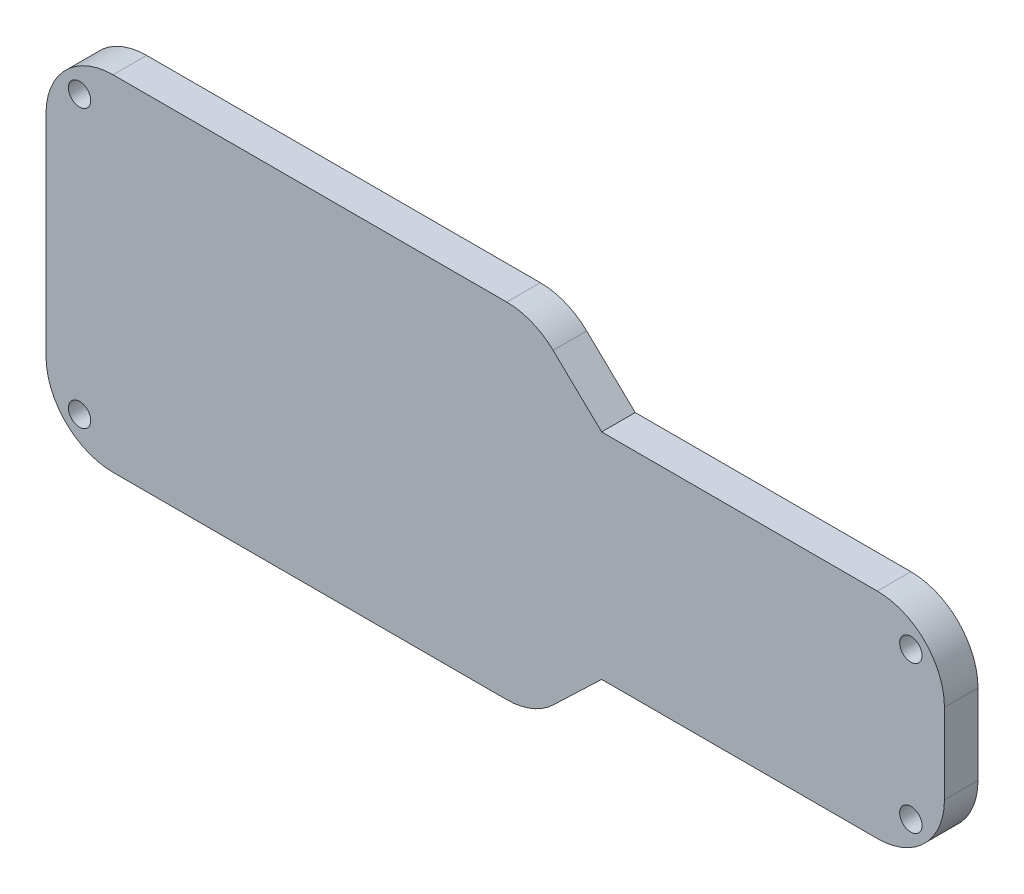
ISO-10303-21;
HEADER;
FILE_DESCRIPTION(('STEP AP214'),'2;1');
FILE_NAME('part.step','',(''),(''),'','','');
FILE_SCHEMA(('AUTOMOTIVE_DESIGN { 1 0 10303 214 1 1 1 1 }'));
ENDSEC;
DATA;
#1=APPLICATION_CONTEXT('core data for automotive mechanical design processes');
#2=APPLICATION_PROTOCOL_DEFINITION('international standard','automotive_design',2000,#1);
#3=PRODUCT_CONTEXT('',#1,'mechanical');
#4=PRODUCT('Part','Part','',(#3));
#5=PRODUCT_RELATED_PRODUCT_CATEGORY('part','',(#4));
#6=PRODUCT_DEFINITION_FORMATION('','',#4);
#7=PRODUCT_DEFINITION_CONTEXT('part definition',#1,'design');
#8=PRODUCT_DEFINITION('design','',#6,#7);
#9=PRODUCT_DEFINITION_SHAPE('','',#8);
#10=(LENGTH_UNIT() NAMED_UNIT(*) SI_UNIT(.MILLI.,.METRE.));
#11=(NAMED_UNIT(*) PLANE_ANGLE_UNIT() SI_UNIT($,.RADIAN.));
#12=(NAMED_UNIT(*) SI_UNIT($,.STERADIAN.) SOLID_ANGLE_UNIT());
#13=UNCERTAINTY_MEASURE_WITH_UNIT(LENGTH_MEASURE(1.E-05),#10,'distance_accuracy_value','');
#14=(GEOMETRIC_REPRESENTATION_CONTEXT(3) GLOBAL_UNCERTAINTY_ASSIGNED_CONTEXT((#13)) GLOBAL_UNIT_ASSIGNED_CONTEXT((#10,
#11,#12)) REPRESENTATION_CONTEXT('',''));
#15=CARTESIAN_POINT('',(0.,0.,0.));
#16=DIRECTION('',(0.,0.,1.));
#17=DIRECTION('',(1.,0.,0.));
#18=AXIS2_PLACEMENT_3D('',#15,#16,#17);
#19=CARTESIAN_POINT('',(-69.81,14.47,3.));
#20=DIRECTION('',(0.,0.,1.));
#21=DIRECTION('',(1.,0.,0.));
#22=AXIS2_PLACEMENT_3D('',#19,#20,#21);
#23=PLANE('',#22);
#24=CARTESIAN_POINT('',(1.5,-1.5,3.));
#25=DIRECTION('',(0.,0.,1.));
#26=DIRECTION('',(1.,0.,0.));
#27=AXIS2_PLACEMENT_3D('',#24,#25,#26);
#28=CIRCLE('',#27,0.999999999999998);
#29=CARTESIAN_POINT('',(2.5,-1.5,3.));
#30=VERTEX_POINT('',#29);
#31=EDGE_CURVE('E317',#30,#30,#28,.T.);
#32=ORIENTED_EDGE('',*,*,#31,.F.);
#33=EDGE_LOOP('',(#32));
#34=FACE_BOUND('',#33,.T.);
#35=CARTESIAN_POINT('',(-72.81,17.47,3.));
#36=DIRECTION('',(0.,0.,1.));
#37=DIRECTION('',(1.,0.,0.));
#38=AXIS2_PLACEMENT_3D('',#35,#36,#37);
#39=CIRCLE('',#38,0.999999999999998);
#40=CARTESIAN_POINT('',(-71.81,17.47,3.));
#41=VERTEX_POINT('',#40);
#42=EDGE_CURVE('E169',#41,#41,#39,.T.);
#43=ORIENTED_EDGE('',*,*,#42,.F.);
#44=EDGE_LOOP('',(#43));
#45=FACE_BOUND('',#44,.T.);
#46=CARTESIAN_POINT('',(-69.81,14.47,3.));
#47=DIRECTION('',(0.,0.,1.));
#48=DIRECTION('',(1.,0.,0.));
#49=AXIS2_PLACEMENT_3D('',#46,#47,#48);
#50=CIRCLE('',#49,6.);
#51=CARTESIAN_POINT('',(-69.81,20.47,3.));
#52=VERTEX_POINT('',#51);
#53=CARTESIAN_POINT('',(-75.81,14.47,3.));
#54=VERTEX_POINT('',#53);
#55=EDGE_CURVE('E192',#52,#54,#50,.T.);
#56=ORIENTED_EDGE('',*,*,#55,.T.);
#57=DIRECTION('',(0.,-1.,0.));
#58=VECTOR('',#57,1.);
#59=CARTESIAN_POINT('',(-75.81,-4.30999999999996,3.));
#60=LINE('',#59,#58);
#61=CARTESIAN_POINT('',(-75.81,-4.30999999999996,3.));
#62=VERTEX_POINT('',#61);
#63=EDGE_CURVE('E110',#54,#62,#60,.T.);
#64=ORIENTED_EDGE('',*,*,#63,.T.);
#65=CARTESIAN_POINT('',(-69.81,-4.31,3.));
#66=DIRECTION('',(0.,0.,1.));
#67=DIRECTION('',(-1.,0.,0.));
#68=AXIS2_PLACEMENT_3D('',#65,#66,#67);
#69=CIRCLE('',#68,6.);
#70=CARTESIAN_POINT('',(-69.81,-10.31,3.));
#71=VERTEX_POINT('',#70);
#72=EDGE_CURVE('E225',#62,#71,#69,.T.);
#73=ORIENTED_EDGE('',*,*,#72,.T.);
#74=DIRECTION('',(1.,0.,0.));
#75=VECTOR('',#74,1.);
#76=CARTESIAN_POINT('',(-34.6250633834129,-10.31,3.));
#77=LINE('',#76,#75);
#78=CARTESIAN_POINT('',(-34.6250633834129,-10.31,3.));
#79=VERTEX_POINT('',#78);
#80=EDGE_CURVE('E244',#71,#79,#77,.T.);
#81=ORIENTED_EDGE('',*,*,#80,.T.);
#82=CARTESIAN_POINT('',(-34.6250633834129,-4.31,3.));
#83=DIRECTION('',(0.,0.,1.));
#84=DIRECTION('',(-1.,0.,0.));
#85=AXIS2_PLACEMENT_3D('',#82,#83,#84);
#86=CIRCLE('',#85,6.);
#87=CARTESIAN_POINT('',(-30.4784864360972,-8.6465769473157,3.));
#88=VERTEX_POINT('',#87);
#89=EDGE_CURVE('E241',#79,#88,#86,.T.);
#90=ORIENTED_EDGE('',*,*,#89,.T.);
#91=DIRECTION('',(0.722762824552617,0.691096157885951,0.));
#92=VECTOR('',#91,1.);
#93=CARTESIAN_POINT('',(-26.1419094887815,-4.5,3.));
#94=LINE('',#93,#92);
#95=CARTESIAN_POINT('',(-26.1419094887815,-4.5,3.));
#96=VERTEX_POINT('',#95);
#97=EDGE_CURVE('E243',#88,#96,#94,.T.);
#98=ORIENTED_EDGE('',*,*,#97,.T.);
#99=DIRECTION('',(1.,0.,0.));
#100=VECTOR('',#99,1.);
#101=CARTESIAN_POINT('',(-1.50000000000004,-4.5,3.));
#102=LINE('',#101,#100);
#103=CARTESIAN_POINT('',(-1.50000000000004,-4.5,3.));
#104=VERTEX_POINT('',#103);
#105=EDGE_CURVE('E246',#96,#104,#102,.T.);
#106=ORIENTED_EDGE('',*,*,#105,.T.);
#107=CARTESIAN_POINT('',(-1.5,1.5,3.));
#108=DIRECTION('',(0.,0.,1.));
#109=DIRECTION('',(-1.,0.,0.));
#110=AXIS2_PLACEMENT_3D('',#107,#108,#109);
#111=CIRCLE('',#110,6.);
#112=CARTESIAN_POINT('',(4.5,1.50000000000002,3.));
#113=VERTEX_POINT('',#112);
#114=EDGE_CURVE('E252',#104,#113,#111,.T.);
#115=ORIENTED_EDGE('',*,*,#114,.T.);
#116=DIRECTION('',(0.,1.,0.));
#117=VECTOR('',#116,1.);
#118=CARTESIAN_POINT('',(4.5,8.65999999999997,3.));
#119=LINE('',#118,#117);
#120=CARTESIAN_POINT('',(4.5,8.65999999999997,3.));
#121=VERTEX_POINT('',#120);
#122=EDGE_CURVE('E254',#113,#121,#119,.T.);
#123=ORIENTED_EDGE('',*,*,#122,.T.);
#124=CARTESIAN_POINT('',(-1.5,8.66000000000001,3.));
#125=DIRECTION('',(0.,0.,1.));
#126=DIRECTION('',(-1.,0.,0.));
#127=AXIS2_PLACEMENT_3D('',#124,#125,#126);
#128=CIRCLE('',#127,6.);
#129=CARTESIAN_POINT('',(-1.50000000000002,14.66,3.));
#130=VERTEX_POINT('',#129);
#131=EDGE_CURVE('E256',#121,#130,#128,.T.);
#132=ORIENTED_EDGE('',*,*,#131,.T.);
#133=DIRECTION('',(-1.,0.,0.));
#134=VECTOR('',#133,1.);
#135=CARTESIAN_POINT('',(-26.1419094887815,14.66,3.));
#136=LINE('',#135,#134);
#137=CARTESIAN_POINT('',(-26.1419094887815,14.66,3.));
#138=VERTEX_POINT('',#137);
#139=EDGE_CURVE('E147',#130,#138,#136,.T.);
#140=ORIENTED_EDGE('',*,*,#139,.T.);
#141=DIRECTION('',(-0.722762824552617,0.691096157885951,0.));
#142=VECTOR('',#141,1.);
#143=CARTESIAN_POINT('',(-30.4784864360972,18.8065769473157,3.));
#144=LINE('',#143,#142);
#145=CARTESIAN_POINT('',(-30.4784864360972,18.8065769473157,3.));
#146=VERTEX_POINT('',#145);
#147=EDGE_CURVE('E141',#138,#146,#144,.T.);
#148=ORIENTED_EDGE('',*,*,#147,.T.);
#149=CARTESIAN_POINT('',(-34.6250633834129,14.47,3.));
#150=DIRECTION('',(0.,0.,1.));
#151=DIRECTION('',(-1.,0.,0.));
#152=AXIS2_PLACEMENT_3D('',#149,#150,#151);
#153=CIRCLE('',#152,6.);
#154=CARTESIAN_POINT('',(-34.6250633834129,20.47,3.));
#155=VERTEX_POINT('',#154);
#156=EDGE_CURVE('E145',#146,#155,#153,.T.);
#157=ORIENTED_EDGE('',*,*,#156,.T.);
#158=DIRECTION('',(-1.,0.,0.));
#159=VECTOR('',#158,1.);
#160=CARTESIAN_POINT('',(-69.81,20.47,3.));
#161=LINE('',#160,#159);
#162=EDGE_CURVE('E49',#155,#52,#161,.T.);
#163=ORIENTED_EDGE('',*,*,#162,.T.);
#164=EDGE_LOOP('',(#56,#64,#73,#81,#90,#98,#106,#115,#123,#132,#140,#148,#157,#163));
#165=FACE_BOUND('',#164,.T.);
#166=CARTESIAN_POINT('',(-72.81,-7.31,3.));
#167=DIRECTION('',(0.,0.,1.));
#168=DIRECTION('',(1.,0.,0.));
#169=AXIS2_PLACEMENT_3D('',#166,#167,#168);
#170=CIRCLE('',#169,0.999999999999998);
#171=CARTESIAN_POINT('',(-71.81,-7.31,3.));
#172=VERTEX_POINT('',#171);
#173=EDGE_CURVE('E323',#172,#172,#170,.T.);
#174=ORIENTED_EDGE('',*,*,#173,.F.);
#175=EDGE_LOOP('',(#174));
#176=FACE_BOUND('',#175,.T.);
#177=CARTESIAN_POINT('',(1.5,11.66,3.));
#178=DIRECTION('',(0.,0.,1.));
#179=DIRECTION('',(1.,0.,0.));
#180=AXIS2_PLACEMENT_3D('',#177,#178,#179);
#181=CIRCLE('',#180,0.999999999999998);
#182=CARTESIAN_POINT('',(2.5,11.66,3.));
#183=VERTEX_POINT('',#182);
#184=EDGE_CURVE('E308',#183,#183,#181,.T.);
#185=ORIENTED_EDGE('',*,*,#184,.F.);
#186=EDGE_LOOP('',(#185));
#187=FACE_BOUND('',#186,.T.);
#188=ADVANCED_FACE('F32',(#34,#45,#165,#176,#187),#23,.T.);
#189=CARTESIAN_POINT('',(-69.81,14.47,0.));
#190=DIRECTION('',(0.,0.,1.));
#191=DIRECTION('',(1.,0.,0.));
#192=AXIS2_PLACEMENT_3D('',#189,#190,#191);
#193=PLANE('',#192);
#194=CARTESIAN_POINT('',(1.5,-1.5,0.));
#195=DIRECTION('',(0.,0.,1.));
#196=DIRECTION('',(1.,0.,0.));
#197=AXIS2_PLACEMENT_3D('',#194,#195,#196);
#198=CIRCLE('',#197,0.999999999999998);
#199=CARTESIAN_POINT('',(2.5,-1.5,0.));
#200=VERTEX_POINT('',#199);
#201=EDGE_CURVE('E314',#200,#200,#198,.T.);
#202=ORIENTED_EDGE('',*,*,#201,.T.);
#203=EDGE_LOOP('',(#202));
#204=FACE_BOUND('',#203,.T.);
#205=CARTESIAN_POINT('',(-72.81,17.47,0.));
#206=DIRECTION('',(0.,0.,1.));
#207=DIRECTION('',(1.,0.,0.));
#208=AXIS2_PLACEMENT_3D('',#205,#206,#207);
#209=CIRCLE('',#208,0.999999999999998);
#210=CARTESIAN_POINT('',(-71.81,17.47,0.));
#211=VERTEX_POINT('',#210);
#212=EDGE_CURVE('E326',#211,#211,#209,.T.);
#213=ORIENTED_EDGE('',*,*,#212,.T.);
#214=EDGE_LOOP('',(#213));
#215=FACE_BOUND('',#214,.T.);
#216=CARTESIAN_POINT('',(-69.81,14.47,0.));
#217=DIRECTION('',(0.,0.,1.));
#218=DIRECTION('',(1.,0.,0.));
#219=AXIS2_PLACEMENT_3D('',#216,#217,#218);
#220=CIRCLE('',#219,6.);
#221=CARTESIAN_POINT('',(-69.81,20.47,0.));
#222=VERTEX_POINT('',#221);
#223=CARTESIAN_POINT('',(-75.81,14.47,0.));
#224=VERTEX_POINT('',#223);
#225=EDGE_CURVE('E165',#222,#224,#220,.T.);
#226=ORIENTED_EDGE('',*,*,#225,.F.);
#227=DIRECTION('',(-1.,0.,0.));
#228=VECTOR('',#227,1.);
#229=CARTESIAN_POINT('',(-69.81,20.47,0.));
#230=LINE('',#229,#228);
#231=CARTESIAN_POINT('',(-34.6250633834129,20.47,0.));
#232=VERTEX_POINT('',#231);
#233=EDGE_CURVE('E102',#232,#222,#230,.T.);
#234=ORIENTED_EDGE('',*,*,#233,.F.);
#235=CARTESIAN_POINT('',(-34.6250633834129,14.47,0.));
#236=DIRECTION('',(0.,0.,1.));
#237=DIRECTION('',(-1.,0.,0.));
#238=AXIS2_PLACEMENT_3D('',#235,#236,#237);
#239=CIRCLE('',#238,6.);
#240=CARTESIAN_POINT('',(-30.4784864360972,18.8065769473157,0.));
#241=VERTEX_POINT('',#240);
#242=EDGE_CURVE('E96',#241,#232,#239,.T.);
#243=ORIENTED_EDGE('',*,*,#242,.F.);
#244=DIRECTION('',(-0.722762824552617,0.691096157885951,0.));
#245=VECTOR('',#244,1.);
#246=CARTESIAN_POINT('',(-30.4784864360972,18.8065769473157,0.));
#247=LINE('',#246,#245);
#248=CARTESIAN_POINT('',(-26.1419094887815,14.66,0.));
#249=VERTEX_POINT('',#248);
#250=EDGE_CURVE('E155',#249,#241,#247,.T.);
#251=ORIENTED_EDGE('',*,*,#250,.F.);
#252=DIRECTION('',(-1.,0.,0.));
#253=VECTOR('',#252,1.);
#254=CARTESIAN_POINT('',(-26.1419094887815,14.66,0.));
#255=LINE('',#254,#253);
#256=CARTESIAN_POINT('',(-1.50000000000002,14.66,0.));
#257=VERTEX_POINT('',#256);
#258=EDGE_CURVE('E187',#257,#249,#255,.T.);
#259=ORIENTED_EDGE('',*,*,#258,.F.);
#260=CARTESIAN_POINT('',(-1.5,8.66000000000001,0.));
#261=DIRECTION('',(0.,0.,1.));
#262=DIRECTION('',(-1.,0.,0.));
#263=AXIS2_PLACEMENT_3D('',#260,#261,#262);
#264=CIRCLE('',#263,6.);
#265=CARTESIAN_POINT('',(4.5,8.65999999999997,0.));
#266=VERTEX_POINT('',#265);
#267=EDGE_CURVE('E185',#266,#257,#264,.T.);
#268=ORIENTED_EDGE('',*,*,#267,.F.);
#269=DIRECTION('',(0.,1.,0.));
#270=VECTOR('',#269,1.);
#271=CARTESIAN_POINT('',(4.5,8.65999999999997,0.));
#272=LINE('',#271,#270);
#273=CARTESIAN_POINT('',(4.5,1.50000000000002,0.));
#274=VERTEX_POINT('',#273);
#275=EDGE_CURVE('E183',#274,#266,#272,.T.);
#276=ORIENTED_EDGE('',*,*,#275,.F.);
#277=CARTESIAN_POINT('',(-1.5,1.5,0.));
#278=DIRECTION('',(0.,0.,1.));
#279=DIRECTION('',(-1.,0.,0.));
#280=AXIS2_PLACEMENT_3D('',#277,#278,#279);
#281=CIRCLE('',#280,6.);
#282=CARTESIAN_POINT('',(-1.50000000000004,-4.5,0.));
#283=VERTEX_POINT('',#282);
#284=EDGE_CURVE('E181',#283,#274,#281,.T.);
#285=ORIENTED_EDGE('',*,*,#284,.F.);
#286=DIRECTION('',(1.,0.,0.));
#287=VECTOR('',#286,1.);
#288=CARTESIAN_POINT('',(-1.50000000000004,-4.5,0.));
#289=LINE('',#288,#287);
#290=CARTESIAN_POINT('',(-26.1419094887815,-4.5,0.));
#291=VERTEX_POINT('',#290);
#292=EDGE_CURVE('E179',#291,#283,#289,.T.);
#293=ORIENTED_EDGE('',*,*,#292,.F.);
#294=DIRECTION('',(0.722762824552617,0.691096157885951,0.));
#295=VECTOR('',#294,1.);
#296=CARTESIAN_POINT('',(-26.1419094887815,-4.5,0.));
#297=LINE('',#296,#295);
#298=CARTESIAN_POINT('',(-30.4784864360972,-8.6465769473157,0.));
#299=VERTEX_POINT('',#298);
#300=EDGE_CURVE('E177',#299,#291,#297,.T.);
#301=ORIENTED_EDGE('',*,*,#300,.F.);
#302=CARTESIAN_POINT('',(-34.6250633834129,-4.31,0.));
#303=DIRECTION('',(0.,0.,1.));
#304=DIRECTION('',(-1.,0.,0.));
#305=AXIS2_PLACEMENT_3D('',#302,#303,#304);
#306=CIRCLE('',#305,6.);
#307=CARTESIAN_POINT('',(-34.6250633834129,-10.31,0.));
#308=VERTEX_POINT('',#307);
#309=EDGE_CURVE('E175',#308,#299,#306,.T.);
#310=ORIENTED_EDGE('',*,*,#309,.F.);
#311=DIRECTION('',(1.,0.,0.));
#312=VECTOR('',#311,1.);
#313=CARTESIAN_POINT('',(-34.6250633834129,-10.31,0.));
#314=LINE('',#313,#312);
#315=CARTESIAN_POINT('',(-69.81,-10.31,0.));
#316=VERTEX_POINT('',#315);
#317=EDGE_CURVE('E173',#316,#308,#314,.T.);
#318=ORIENTED_EDGE('',*,*,#317,.F.);
#319=CARTESIAN_POINT('',(-69.81,-4.31,0.));
#320=DIRECTION('',(0.,0.,1.));
#321=DIRECTION('',(-1.,0.,0.));
#322=AXIS2_PLACEMENT_3D('',#319,#320,#321);
#323=CIRCLE('',#322,6.);
#324=CARTESIAN_POINT('',(-75.81,-4.30999999999996,0.));
#325=VERTEX_POINT('',#324);
#326=EDGE_CURVE('E171',#325,#316,#323,.T.);
#327=ORIENTED_EDGE('',*,*,#326,.F.);
#328=DIRECTION('',(0.,-1.,0.));
#329=VECTOR('',#328,1.);
#330=CARTESIAN_POINT('',(-75.81,-4.30999999999996,0.));
#331=LINE('',#330,#329);
#332=EDGE_CURVE('E168',#224,#325,#331,.T.);
#333=ORIENTED_EDGE('',*,*,#332,.F.);
#334=EDGE_LOOP('',(#226,#234,#243,#251,#259,#268,#276,#285,#293,#301,#310,#318,#327,#333));
#335=FACE_BOUND('',#334,.T.);
#336=CARTESIAN_POINT('',(-72.81,-7.31,0.));
#337=DIRECTION('',(0.,0.,1.));
#338=DIRECTION('',(1.,0.,0.));
#339=AXIS2_PLACEMENT_3D('',#336,#337,#338);
#340=CIRCLE('',#339,0.999999999999998);
#341=CARTESIAN_POINT('',(-71.81,-7.31,0.));
#342=VERTEX_POINT('',#341);
#343=EDGE_CURVE('E320',#342,#342,#340,.T.);
#344=ORIENTED_EDGE('',*,*,#343,.T.);
#345=EDGE_LOOP('',(#344));
#346=FACE_BOUND('',#345,.T.);
#347=CARTESIAN_POINT('',(1.5,11.66,0.));
#348=DIRECTION('',(0.,0.,1.));
#349=DIRECTION('',(1.,0.,0.));
#350=AXIS2_PLACEMENT_3D('',#347,#348,#349);
#351=CIRCLE('',#350,0.999999999999998);
#352=CARTESIAN_POINT('',(2.5,11.66,0.));
#353=VERTEX_POINT('',#352);
#354=EDGE_CURVE('E311',#353,#353,#351,.T.);
#355=ORIENTED_EDGE('',*,*,#354,.T.);
#356=EDGE_LOOP('',(#355));
#357=FACE_BOUND('',#356,.T.);
#358=ADVANCED_FACE('F229',(#204,#215,#335,#346,#357),#193,.F.);
#359=CARTESIAN_POINT('',(-69.81,14.47,3.));
#360=DIRECTION('',(0.,0.,-1.));
#361=DIRECTION('',(-1.,0.,0.));
#362=AXIS2_PLACEMENT_3D('',#359,#360,#361);
#363=CYLINDRICAL_SURFACE('',#362,6.);
#364=ORIENTED_EDGE('',*,*,#225,.T.);
#365=DIRECTION('',(0.,0.,-1.));
#366=VECTOR('',#365,1.);
#367=CARTESIAN_POINT('',(-75.81,14.47,3.));
#368=LINE('',#367,#366);
#369=EDGE_CURVE('E11',#54,#224,#368,.T.);
#370=ORIENTED_EDGE('',*,*,#369,.F.);
#371=ORIENTED_EDGE('',*,*,#55,.F.);
#372=DIRECTION('',(0.,0.,-1.));
#373=VECTOR('',#372,1.);
#374=CARTESIAN_POINT('',(-69.81,20.47,3.));
#375=LINE('',#374,#373);
#376=EDGE_CURVE('E161',#52,#222,#375,.T.);
#377=ORIENTED_EDGE('',*,*,#376,.T.);
#378=EDGE_LOOP('',(#364,#370,#371,#377));
#379=FACE_BOUND('',#378,.T.);
#380=ADVANCED_FACE('F34',(#379),#363,.T.);
#381=CARTESIAN_POINT('',(-75.81,-4.30999999999996,3.));
#382=DIRECTION('',(1.,0.,0.));
#383=DIRECTION('',(0.,0.,-1.));
#384=AXIS2_PLACEMENT_3D('',#381,#382,#383);
#385=PLANE('',#384);
#386=ORIENTED_EDGE('',*,*,#332,.T.);
#387=DIRECTION('',(0.,0.,-1.));
#388=VECTOR('',#387,1.);
#389=CARTESIAN_POINT('',(-75.81,-4.30999999999996,3.));
#390=LINE('',#389,#388);
#391=EDGE_CURVE('E41',#62,#325,#390,.T.);
#392=ORIENTED_EDGE('',*,*,#391,.F.);
#393=ORIENTED_EDGE('',*,*,#63,.F.);
#394=ORIENTED_EDGE('',*,*,#369,.T.);
#395=EDGE_LOOP('',(#386,#392,#393,#394));
#396=FACE_BOUND('',#395,.T.);
#397=ADVANCED_FACE('F455',(#396),#385,.F.);
#398=CARTESIAN_POINT('',(-69.81,-4.31,3.));
#399=DIRECTION('',(0.,0.,-1.));
#400=DIRECTION('',(-1.,0.,0.));
#401=AXIS2_PLACEMENT_3D('',#398,#399,#400);
#402=CYLINDRICAL_SURFACE('',#401,6.);
#403=ORIENTED_EDGE('',*,*,#326,.T.);
#404=DIRECTION('',(0.,0.,-1.));
#405=VECTOR('',#404,1.);
#406=CARTESIAN_POINT('',(-69.81,-10.31,3.));
#407=LINE('',#406,#405);
#408=EDGE_CURVE('E217',#71,#316,#407,.T.);
#409=ORIENTED_EDGE('',*,*,#408,.F.);
#410=ORIENTED_EDGE('',*,*,#72,.F.);
#411=ORIENTED_EDGE('',*,*,#391,.T.);
#412=EDGE_LOOP('',(#403,#409,#410,#411));
#413=FACE_BOUND('',#412,.T.);
#414=ADVANCED_FACE('F223',(#413),#402,.T.);
#415=CARTESIAN_POINT('',(-34.6250633834129,-10.31,3.));
#416=DIRECTION('',(0.,1.,0.));
#417=DIRECTION('',(0.,0.,1.));
#418=AXIS2_PLACEMENT_3D('',#415,#416,#417);
#419=PLANE('',#418);
#420=ORIENTED_EDGE('',*,*,#317,.T.);
#421=DIRECTION('',(0.,0.,-1.));
#422=VECTOR('',#421,1.);
#423=CARTESIAN_POINT('',(-34.6250633834129,-10.31,3.));
#424=LINE('',#423,#422);
#425=EDGE_CURVE('E214',#79,#308,#424,.T.);
#426=ORIENTED_EDGE('',*,*,#425,.F.);
#427=ORIENTED_EDGE('',*,*,#80,.F.);
#428=ORIENTED_EDGE('',*,*,#408,.T.);
#429=EDGE_LOOP('',(#420,#426,#427,#428));
#430=FACE_BOUND('',#429,.T.);
#431=ADVANCED_FACE('F235',(#430),#419,.F.);
#432=CARTESIAN_POINT('',(-34.6250633834129,-4.31,3.));
#433=DIRECTION('',(0.,0.,-1.));
#434=DIRECTION('',(-1.,0.,0.));
#435=AXIS2_PLACEMENT_3D('',#432,#433,#434);
#436=CYLINDRICAL_SURFACE('',#435,6.);
#437=ORIENTED_EDGE('',*,*,#309,.T.);
#438=DIRECTION('',(0.,0.,-1.));
#439=VECTOR('',#438,1.);
#440=CARTESIAN_POINT('',(-30.4784864360972,-8.6465769473157,3.));
#441=LINE('',#440,#439);
#442=EDGE_CURVE('E211',#88,#299,#441,.T.);
#443=ORIENTED_EDGE('',*,*,#442,.F.);
#444=ORIENTED_EDGE('',*,*,#89,.F.);
#445=ORIENTED_EDGE('',*,*,#425,.T.);
#446=EDGE_LOOP('',(#437,#443,#444,#445));
#447=FACE_BOUND('',#446,.T.);
#448=ADVANCED_FACE('F239',(#447),#436,.T.);
#449=CARTESIAN_POINT('',(-26.1419094887815,-4.5,3.));
#450=DIRECTION('',(-0.691096157885951,0.722762824552617,0.));
#451=DIRECTION('',(-0.722762824552617,-0.691096157885951,0.));
#452=AXIS2_PLACEMENT_3D('',#449,#450,#451);
#453=PLANE('',#452);
#454=ORIENTED_EDGE('',*,*,#300,.T.);
#455=DIRECTION('',(0.,0.,-1.));
#456=VECTOR('',#455,1.);
#457=CARTESIAN_POINT('',(-26.1419094887815,-4.5,3.));
#458=LINE('',#457,#456);
#459=EDGE_CURVE('E208',#96,#291,#458,.T.);
#460=ORIENTED_EDGE('',*,*,#459,.F.);
#461=ORIENTED_EDGE('',*,*,#97,.F.);
#462=ORIENTED_EDGE('',*,*,#442,.T.);
#463=EDGE_LOOP('',(#454,#460,#461,#462));
#464=FACE_BOUND('',#463,.T.);
#465=ADVANCED_FACE('F420',(#464),#453,.F.);
#466=CARTESIAN_POINT('',(-1.50000000000004,-4.5,3.));
#467=DIRECTION('',(0.,1.,0.));
#468=DIRECTION('',(-1.,0.,0.));
#469=AXIS2_PLACEMENT_3D('',#466,#467,#468);
#470=PLANE('',#469);
#471=ORIENTED_EDGE('',*,*,#292,.T.);
#472=DIRECTION('',(0.,0.,-1.));
#473=VECTOR('',#472,1.);
#474=CARTESIAN_POINT('',(-1.50000000000004,-4.5,3.));
#475=LINE('',#474,#473);
#476=EDGE_CURVE('E205',#104,#283,#475,.T.);
#477=ORIENTED_EDGE('',*,*,#476,.F.);
#478=ORIENTED_EDGE('',*,*,#105,.F.);
#479=ORIENTED_EDGE('',*,*,#459,.T.);
#480=EDGE_LOOP('',(#471,#477,#478,#479));
#481=FACE_BOUND('',#480,.T.);
#482=ADVANCED_FACE('F410',(#481),#470,.F.);
#483=CARTESIAN_POINT('',(-1.5,1.5,3.));
#484=DIRECTION('',(0.,0.,-1.));
#485=DIRECTION('',(-1.,0.,0.));
#486=AXIS2_PLACEMENT_3D('',#483,#484,#485);
#487=CYLINDRICAL_SURFACE('',#486,6.);
#488=ORIENTED_EDGE('',*,*,#284,.T.);
#489=DIRECTION('',(0.,0.,-1.));
#490=VECTOR('',#489,1.);
#491=CARTESIAN_POINT('',(4.5,1.50000000000002,3.));
#492=LINE('',#491,#490);
#493=EDGE_CURVE('E202',#113,#274,#492,.T.);
#494=ORIENTED_EDGE('',*,*,#493,.F.);
#495=ORIENTED_EDGE('',*,*,#114,.F.);
#496=ORIENTED_EDGE('',*,*,#476,.T.);
#497=EDGE_LOOP('',(#488,#494,#495,#496));
#498=FACE_BOUND('',#497,.T.);
#499=ADVANCED_FACE('F400',(#498),#487,.T.);
#500=CARTESIAN_POINT('',(4.5,8.65999999999997,3.));
#501=DIRECTION('',(-1.,0.,0.));
#502=DIRECTION('',(0.,-1.,0.));
#503=AXIS2_PLACEMENT_3D('',#500,#501,#502);
#504=PLANE('',#503);
#505=ORIENTED_EDGE('',*,*,#275,.T.);
#506=DIRECTION('',(0.,0.,-1.));
#507=VECTOR('',#506,1.);
#508=CARTESIAN_POINT('',(4.5,8.65999999999997,3.));
#509=LINE('',#508,#507);
#510=EDGE_CURVE('E199',#121,#266,#509,.T.);
#511=ORIENTED_EDGE('',*,*,#510,.F.);
#512=ORIENTED_EDGE('',*,*,#122,.F.);
#513=ORIENTED_EDGE('',*,*,#493,.T.);
#514=EDGE_LOOP('',(#505,#511,#512,#513));
#515=FACE_BOUND('',#514,.T.);
#516=ADVANCED_FACE('F391',(#515),#504,.F.);
#517=CARTESIAN_POINT('',(-1.5,8.66000000000001,3.));
#518=DIRECTION('',(0.,0.,-1.));
#519=DIRECTION('',(-1.,0.,0.));
#520=AXIS2_PLACEMENT_3D('',#517,#518,#519);
#521=CYLINDRICAL_SURFACE('',#520,6.);
#522=ORIENTED_EDGE('',*,*,#267,.T.);
#523=DIRECTION('',(0.,0.,-1.));
#524=VECTOR('',#523,1.);
#525=CARTESIAN_POINT('',(-1.50000000000002,14.66,3.));
#526=LINE('',#525,#524);
#527=EDGE_CURVE('E196',#130,#257,#526,.T.);
#528=ORIENTED_EDGE('',*,*,#527,.F.);
#529=ORIENTED_EDGE('',*,*,#131,.F.);
#530=ORIENTED_EDGE('',*,*,#510,.T.);
#531=EDGE_LOOP('',(#522,#528,#529,#530));
#532=FACE_BOUND('',#531,.T.);
#533=ADVANCED_FACE('F262',(#532),#521,.T.);
#534=CARTESIAN_POINT('',(-26.1419094887815,14.66,3.));
#535=DIRECTION('',(0.,-1.,0.));
#536=DIRECTION('',(1.,0.,0.));
#537=AXIS2_PLACEMENT_3D('',#534,#535,#536);
#538=PLANE('',#537);
#539=ORIENTED_EDGE('',*,*,#258,.T.);
#540=DIRECTION('',(0.,0.,-1.));
#541=VECTOR('',#540,1.);
#542=CARTESIAN_POINT('',(-26.1419094887815,14.66,3.));
#543=LINE('',#542,#541);
#544=EDGE_CURVE('E156',#138,#249,#543,.T.);
#545=ORIENTED_EDGE('',*,*,#544,.F.);
#546=ORIENTED_EDGE('',*,*,#139,.F.);
#547=ORIENTED_EDGE('',*,*,#527,.T.);
#548=EDGE_LOOP('',(#539,#545,#546,#547));
#549=FACE_BOUND('',#548,.T.);
#550=ADVANCED_FACE('F266',(#549),#538,.F.);
#551=CARTESIAN_POINT('',(-30.4784864360972,18.8065769473157,3.));
#552=DIRECTION('',(-0.691096157885951,-0.722762824552617,0.));
#553=DIRECTION('',(0.722762824552617,-0.691096157885951,0.));
#554=AXIS2_PLACEMENT_3D('',#551,#552,#553);
#555=PLANE('',#554);
#556=ORIENTED_EDGE('',*,*,#250,.T.);
#557=DIRECTION('',(0.,0.,-1.));
#558=VECTOR('',#557,1.);
#559=CARTESIAN_POINT('',(-30.4784864360972,18.8065769473157,3.));
#560=LINE('',#559,#558);
#561=EDGE_CURVE('E152',#146,#241,#560,.T.);
#562=ORIENTED_EDGE('',*,*,#561,.F.);
#563=ORIENTED_EDGE('',*,*,#147,.F.);
#564=ORIENTED_EDGE('',*,*,#544,.T.);
#565=EDGE_LOOP('',(#556,#562,#563,#564));
#566=FACE_BOUND('',#565,.T.);
#567=ADVANCED_FACE('F153',(#566),#555,.F.);
#568=CARTESIAN_POINT('',(-34.6250633834129,14.47,3.));
#569=DIRECTION('',(0.,0.,-1.));
#570=DIRECTION('',(-1.,0.,0.));
#571=AXIS2_PLACEMENT_3D('',#568,#569,#570);
#572=CYLINDRICAL_SURFACE('',#571,6.);
#573=ORIENTED_EDGE('',*,*,#242,.T.);
#574=DIRECTION('',(0.,0.,-1.));
#575=VECTOR('',#574,1.);
#576=CARTESIAN_POINT('',(-34.6250633834129,20.47,3.));
#577=LINE('',#576,#575);
#578=EDGE_CURVE('E157',#155,#232,#577,.T.);
#579=ORIENTED_EDGE('',*,*,#578,.F.);
#580=ORIENTED_EDGE('',*,*,#156,.F.);
#581=ORIENTED_EDGE('',*,*,#561,.T.);
#582=EDGE_LOOP('',(#573,#579,#580,#581));
#583=FACE_BOUND('',#582,.T.);
#584=ADVANCED_FACE('F159',(#583),#572,.T.);
#585=CARTESIAN_POINT('',(-69.81,20.47,3.));
#586=DIRECTION('',(0.,-1.,0.));
#587=DIRECTION('',(0.,0.,-1.));
#588=AXIS2_PLACEMENT_3D('',#585,#586,#587);
#589=PLANE('',#588);
#590=ORIENTED_EDGE('',*,*,#233,.T.);
#591=ORIENTED_EDGE('',*,*,#376,.F.);
#592=ORIENTED_EDGE('',*,*,#162,.F.);
#593=ORIENTED_EDGE('',*,*,#578,.T.);
#594=EDGE_LOOP('',(#590,#591,#592,#593));
#595=FACE_BOUND('',#594,.T.);
#596=ADVANCED_FACE('F270',(#595),#589,.F.);
#597=CARTESIAN_POINT('',(-72.81,17.47,3.));
#598=DIRECTION('',(0.,0.,-1.));
#599=DIRECTION('',(-1.,0.,0.));
#600=AXIS2_PLACEMENT_3D('',#597,#598,#599);
#601=CYLINDRICAL_SURFACE('',#600,0.999999999999998);
#602=ORIENTED_EDGE('',*,*,#42,.T.);
#603=EDGE_LOOP('',(#602));
#604=FACE_BOUND('',#603,.T.);
#605=ORIENTED_EDGE('',*,*,#212,.F.);
#606=EDGE_LOOP('',(#605));
#607=FACE_BOUND('',#606,.T.);
#608=ADVANCED_FACE('F272',(#604,#607),#601,.F.);
#609=CARTESIAN_POINT('',(-72.81,-7.31,3.));
#610=DIRECTION('',(0.,0.,-1.));
#611=DIRECTION('',(-1.,0.,0.));
#612=AXIS2_PLACEMENT_3D('',#609,#610,#611);
#613=CYLINDRICAL_SURFACE('',#612,0.999999999999998);
#614=ORIENTED_EDGE('',*,*,#173,.T.);
#615=EDGE_LOOP('',(#614));
#616=FACE_BOUND('',#615,.T.);
#617=ORIENTED_EDGE('',*,*,#343,.F.);
#618=EDGE_LOOP('',(#617));
#619=FACE_BOUND('',#618,.T.);
#620=ADVANCED_FACE('F278',(#616,#619),#613,.F.);
#621=CARTESIAN_POINT('',(1.5,-1.5,3.));
#622=DIRECTION('',(0.,0.,-1.));
#623=DIRECTION('',(-1.,0.,0.));
#624=AXIS2_PLACEMENT_3D('',#621,#622,#623);
#625=CYLINDRICAL_SURFACE('',#624,0.999999999999998);
#626=ORIENTED_EDGE('',*,*,#31,.T.);
#627=EDGE_LOOP('',(#626));
#628=FACE_BOUND('',#627,.T.);
#629=ORIENTED_EDGE('',*,*,#201,.F.);
#630=EDGE_LOOP('',(#629));
#631=FACE_BOUND('',#630,.T.);
#632=ADVANCED_FACE('F295',(#628,#631),#625,.F.);
#633=CARTESIAN_POINT('',(1.5,11.66,3.));
#634=DIRECTION('',(0.,0.,-1.));
#635=DIRECTION('',(-1.,0.,0.));
#636=AXIS2_PLACEMENT_3D('',#633,#634,#635);
#637=CYLINDRICAL_SURFACE('',#636,0.999999999999998);
#638=ORIENTED_EDGE('',*,*,#184,.T.);
#639=EDGE_LOOP('',(#638));
#640=FACE_BOUND('',#639,.T.);
#641=ORIENTED_EDGE('',*,*,#354,.F.);
#642=EDGE_LOOP('',(#641));
#643=FACE_BOUND('',#642,.T.);
#644=ADVANCED_FACE('F299',(#640,#643),#637,.F.);
#645=CLOSED_SHELL('',(#188,#358,#380,#397,#414,#431,#448,#465,#482,#499,#516,#533,#550,#567,
#584,#596,#608,#620,#632,#644));
#646=MANIFOLD_SOLID_BREP('B2',#645);
#647=ADVANCED_BREP_SHAPE_REPRESENTATION('',(#18,#646),#14);
#648=SHAPE_DEFINITION_REPRESENTATION(#9,#647);
ENDSEC;
END-ISO-10303-21;
